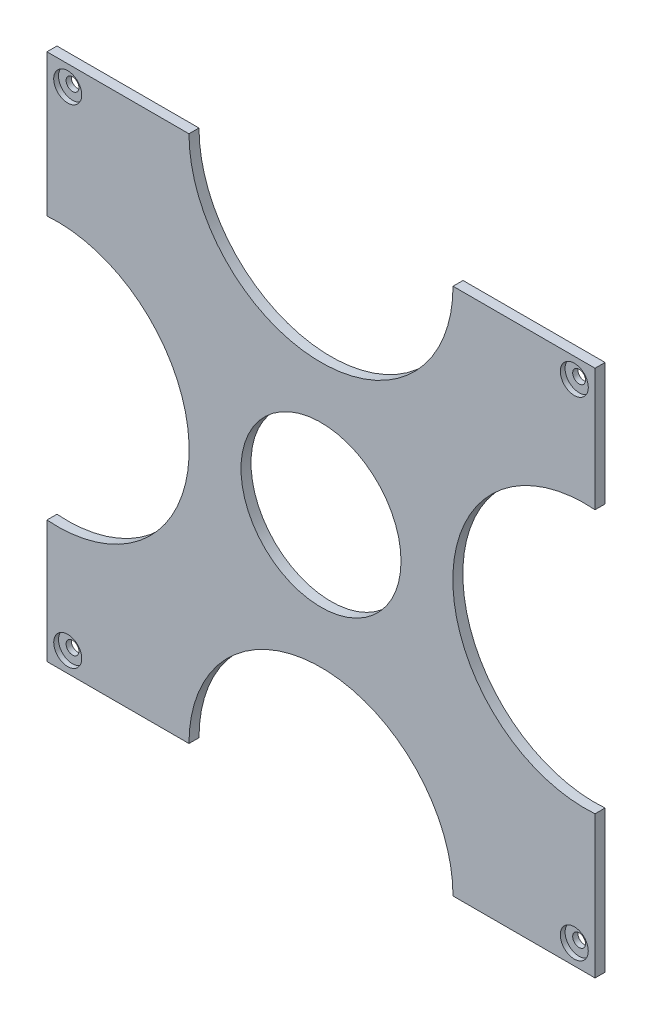
ISO-10303-21;
HEADER;
FILE_DESCRIPTION(('STEP AP214'),'2;1');
FILE_NAME('part.step','',(''),(''),'','','');
FILE_SCHEMA(('AUTOMOTIVE_DESIGN { 1 0 10303 214 1 1 1 1 }'));
ENDSEC;
DATA;
#1=APPLICATION_CONTEXT('core data for automotive mechanical design processes');
#2=APPLICATION_PROTOCOL_DEFINITION('international standard','automotive_design',2000,#1);
#3=PRODUCT_CONTEXT('',#1,'mechanical');
#4=PRODUCT('Part','Part','',(#3));
#5=PRODUCT_RELATED_PRODUCT_CATEGORY('part','',(#4));
#6=PRODUCT_DEFINITION_FORMATION('','',#4);
#7=PRODUCT_DEFINITION_CONTEXT('part definition',#1,'design');
#8=PRODUCT_DEFINITION('design','',#6,#7);
#9=PRODUCT_DEFINITION_SHAPE('','',#8);
#10=(LENGTH_UNIT() NAMED_UNIT(*) SI_UNIT(.MILLI.,.METRE.));
#11=(NAMED_UNIT(*) PLANE_ANGLE_UNIT() SI_UNIT($,.RADIAN.));
#12=(NAMED_UNIT(*) SI_UNIT($,.STERADIAN.) SOLID_ANGLE_UNIT());
#13=UNCERTAINTY_MEASURE_WITH_UNIT(LENGTH_MEASURE(1.E-05),#10,'distance_accuracy_value','');
#14=(GEOMETRIC_REPRESENTATION_CONTEXT(3) GLOBAL_UNCERTAINTY_ASSIGNED_CONTEXT((#13)) GLOBAL_UNIT_ASSIGNED_CONTEXT((#10,
#11,#12)) REPRESENTATION_CONTEXT('',''));
#15=CARTESIAN_POINT('',(0.,0.,0.));
#16=DIRECTION('',(0.,0.,1.));
#17=DIRECTION('',(1.,0.,0.));
#18=AXIS2_PLACEMENT_3D('',#15,#16,#17);
#19=CARTESIAN_POINT('',(-63.3106060606061,61.,2.5));
#20=DIRECTION('',(0.,0.,-1.));
#21=DIRECTION('',(-1.,0.,0.));
#22=AXIS2_PLACEMENT_3D('',#19,#20,#21);
#23=CYLINDRICAL_SURFACE('',#22,1.6);
#24=CARTESIAN_POINT('',(-63.3106060606061,61.,0.));
#25=DIRECTION('',(0.,0.,1.));
#26=DIRECTION('',(1.,0.,0.));
#27=AXIS2_PLACEMENT_3D('',#24,#25,#26);
#28=CIRCLE('',#27,1.6);
#29=CARTESIAN_POINT('',(-61.7106060606061,61.,0.));
#30=VERTEX_POINT('',#29);
#31=EDGE_CURVE('E560',#30,#30,#28,.T.);
#32=ORIENTED_EDGE('',*,*,#31,.F.);
#33=EDGE_LOOP('',(#32));
#34=FACE_BOUND('',#33,.T.);
#35=CARTESIAN_POINT('',(-63.3106060606061,61.,1.3));
#36=DIRECTION('',(0.,0.,1.));
#37=DIRECTION('',(1.,0.,0.));
#38=AXIS2_PLACEMENT_3D('',#35,#36,#37);
#39=CIRCLE('',#38,1.6);
#40=CARTESIAN_POINT('',(-61.7106060606061,61.,1.3));
#41=VERTEX_POINT('',#40);
#42=EDGE_CURVE('E41',#41,#41,#39,.T.);
#43=ORIENTED_EDGE('',*,*,#42,.T.);
#44=EDGE_LOOP('',(#43));
#45=FACE_BOUND('',#44,.T.);
#46=ADVANCED_FACE('F37',(#34,#45),#23,.F.);
#47=CARTESIAN_POINT('',(63.3106060606061,-61.,2.5));
#48=DIRECTION('',(0.,0.,-1.));
#49=DIRECTION('',(-1.,0.,0.));
#50=AXIS2_PLACEMENT_3D('',#47,#48,#49);
#51=CYLINDRICAL_SURFACE('',#50,1.60000000000001);
#52=CARTESIAN_POINT('',(63.3106060606061,-61.,0.));
#53=DIRECTION('',(0.,0.,1.));
#54=DIRECTION('',(1.,0.,0.));
#55=AXIS2_PLACEMENT_3D('',#52,#53,#54);
#56=CIRCLE('',#55,1.60000000000001);
#57=CARTESIAN_POINT('',(64.9106060606061,-61.,0.));
#58=VERTEX_POINT('',#57);
#59=EDGE_CURVE('E349',#58,#58,#56,.T.);
#60=ORIENTED_EDGE('',*,*,#59,.F.);
#61=EDGE_LOOP('',(#60));
#62=FACE_BOUND('',#61,.T.);
#63=CARTESIAN_POINT('',(63.3106060606061,-61.,1.3));
#64=DIRECTION('',(0.,0.,1.));
#65=DIRECTION('',(1.,0.,0.));
#66=AXIS2_PLACEMENT_3D('',#63,#64,#65);
#67=CIRCLE('',#66,1.60000000000001);
#68=CARTESIAN_POINT('',(64.9106060606061,-61.,1.3));
#69=VERTEX_POINT('',#68);
#70=EDGE_CURVE('E252',#69,#69,#67,.T.);
#71=ORIENTED_EDGE('',*,*,#70,.T.);
#72=EDGE_LOOP('',(#71));
#73=FACE_BOUND('',#72,.T.);
#74=ADVANCED_FACE('F276',(#62,#73),#51,.F.);
#75=CARTESIAN_POINT('',(65.9544110739646,2.45268422070566,2.5));
#76=DIRECTION('',(0.,0.,-1.));
#77=DIRECTION('',(-1.,0.,0.));
#78=AXIS2_PLACEMENT_3D('',#75,#76,#77);
#79=CYLINDRICAL_SURFACE('',#78,33.);
#80=CARTESIAN_POINT('',(65.9544110739646,2.45268422070566,0.));
#81=DIRECTION('',(0.,0.,1.));
#82=DIRECTION('',(1.,0.,0.));
#83=AXIS2_PLACEMENT_3D('',#80,#81,#82);
#84=CIRCLE('',#83,33.);
#85=CARTESIAN_POINT('',(68.5,35.3543555615304,0.));
#86=VERTEX_POINT('',#85);
#87=CARTESIAN_POINT('',(68.5,-30.4489871201191,0.));
#88=VERTEX_POINT('',#87);
#89=EDGE_CURVE('E242',#86,#88,#84,.T.);
#90=ORIENTED_EDGE('',*,*,#89,.F.);
#91=DIRECTION('',(0.,0.,-1.));
#92=VECTOR('',#91,1.);
#93=CARTESIAN_POINT('',(68.5,35.3543555615304,2.5));
#94=LINE('',#93,#92);
#95=CARTESIAN_POINT('',(68.5,35.3543555615304,2.5));
#96=VERTEX_POINT('',#95);
#97=EDGE_CURVE('E11',#96,#86,#94,.T.);
#98=ORIENTED_EDGE('',*,*,#97,.F.);
#99=CARTESIAN_POINT('',(65.9544110739646,2.45268422070566,2.5));
#100=DIRECTION('',(0.,0.,1.));
#101=DIRECTION('',(1.,0.,0.));
#102=AXIS2_PLACEMENT_3D('',#99,#100,#101);
#103=CIRCLE('',#102,33.);
#104=CARTESIAN_POINT('',(68.5,-30.4489871201191,2.5));
#105=VERTEX_POINT('',#104);
#106=EDGE_CURVE('E178',#96,#105,#103,.T.);
#107=ORIENTED_EDGE('',*,*,#106,.T.);
#108=DIRECTION('',(0.,0.,-1.));
#109=VECTOR('',#108,1.);
#110=CARTESIAN_POINT('',(68.5,-30.4489871201191,2.5));
#111=LINE('',#110,#109);
#112=EDGE_CURVE('E56',#105,#88,#111,.T.);
#113=ORIENTED_EDGE('',*,*,#112,.T.);
#114=EDGE_LOOP('',(#90,#98,#107,#113));
#115=FACE_BOUND('',#114,.T.);
#116=ADVANCED_FACE('F39',(#115),#79,.F.);
#117=CARTESIAN_POINT('',(68.5,0.,2.5));
#118=DIRECTION('',(1.,0.,0.));
#119=DIRECTION('',(0.,1.,0.));
#120=AXIS2_PLACEMENT_3D('',#117,#118,#119);
#121=PLANE('',#120);
#122=DIRECTION('',(0.,-1.,0.));
#123=VECTOR('',#122,1.);
#124=CARTESIAN_POINT('',(68.5,0.,0.));
#125=LINE('',#124,#123);
#126=CARTESIAN_POINT('',(68.5,66.,0.));
#127=VERTEX_POINT('',#126);
#128=EDGE_CURVE('E244',#127,#86,#125,.T.);
#129=ORIENTED_EDGE('',*,*,#128,.F.);
#130=DIRECTION('',(0.,0.,-1.));
#131=VECTOR('',#130,1.);
#132=CARTESIAN_POINT('',(68.5,66.,2.5));
#133=LINE('',#132,#131);
#134=CARTESIAN_POINT('',(68.5,66.,2.5));
#135=VERTEX_POINT('',#134);
#136=EDGE_CURVE('E47',#135,#127,#133,.T.);
#137=ORIENTED_EDGE('',*,*,#136,.F.);
#138=DIRECTION('',(0.,-1.,0.));
#139=VECTOR('',#138,1.);
#140=CARTESIAN_POINT('',(68.5,0.,2.5));
#141=LINE('',#140,#139);
#142=EDGE_CURVE('E155',#135,#96,#141,.T.);
#143=ORIENTED_EDGE('',*,*,#142,.T.);
#144=ORIENTED_EDGE('',*,*,#97,.T.);
#145=EDGE_LOOP('',(#129,#137,#143,#144));
#146=FACE_BOUND('',#145,.T.);
#147=ADVANCED_FACE('F295',(#146),#121,.T.);
#148=CARTESIAN_POINT('',(0.,66.,2.5));
#149=DIRECTION('',(0.,1.,0.));
#150=DIRECTION('',(0.,0.,1.));
#151=AXIS2_PLACEMENT_3D('',#148,#149,#150);
#152=PLANE('',#151);
#153=DIRECTION('',(1.,0.,0.));
#154=VECTOR('',#153,1.);
#155=CARTESIAN_POINT('',(0.,66.,0.));
#156=LINE('',#155,#154);
#157=CARTESIAN_POINT('',(33.,66.,0.));
#158=VERTEX_POINT('',#157);
#159=EDGE_CURVE('E330',#158,#127,#156,.T.);
#160=ORIENTED_EDGE('',*,*,#159,.F.);
#161=DIRECTION('',(0.,0.,-1.));
#162=VECTOR('',#161,1.);
#163=CARTESIAN_POINT('',(33.,66.,2.5));
#164=LINE('',#163,#162);
#165=CARTESIAN_POINT('',(33.,66.,2.5));
#166=VERTEX_POINT('',#165);
#167=EDGE_CURVE('E325',#166,#158,#164,.T.);
#168=ORIENTED_EDGE('',*,*,#167,.F.);
#169=DIRECTION('',(1.,0.,0.));
#170=VECTOR('',#169,1.);
#171=CARTESIAN_POINT('',(0.,66.,2.5));
#172=LINE('',#171,#170);
#173=EDGE_CURVE('E171',#166,#135,#172,.T.);
#174=ORIENTED_EDGE('',*,*,#173,.T.);
#175=ORIENTED_EDGE('',*,*,#136,.T.);
#176=EDGE_LOOP('',(#160,#168,#174,#175));
#177=FACE_BOUND('',#176,.T.);
#178=ADVANCED_FACE('F313',(#177),#152,.T.);
#179=CARTESIAN_POINT('',(0.,66.,2.5));
#180=DIRECTION('',(0.,0.,-1.));
#181=DIRECTION('',(-1.,0.,0.));
#182=AXIS2_PLACEMENT_3D('',#179,#180,#181);
#183=CYLINDRICAL_SURFACE('',#182,33.);
#184=CARTESIAN_POINT('',(0.,66.,0.));
#185=DIRECTION('',(0.,0.,1.));
#186=DIRECTION('',(1.,0.,0.));
#187=AXIS2_PLACEMENT_3D('',#184,#185,#186);
#188=CIRCLE('',#187,33.);
#189=CARTESIAN_POINT('',(-33.,66.,0.));
#190=VERTEX_POINT('',#189);
#191=EDGE_CURVE('E321',#190,#158,#188,.T.);
#192=ORIENTED_EDGE('',*,*,#191,.F.);
#193=DIRECTION('',(0.,0.,-1.));
#194=VECTOR('',#193,1.);
#195=CARTESIAN_POINT('',(-33.,66.,2.5));
#196=LINE('',#195,#194);
#197=CARTESIAN_POINT('',(-33.,66.,2.5));
#198=VERTEX_POINT('',#197);
#199=EDGE_CURVE('E323',#198,#190,#196,.T.);
#200=ORIENTED_EDGE('',*,*,#199,.F.);
#201=CARTESIAN_POINT('',(0.,66.,2.5));
#202=DIRECTION('',(0.,0.,1.));
#203=DIRECTION('',(1.,0.,0.));
#204=AXIS2_PLACEMENT_3D('',#201,#202,#203);
#205=CIRCLE('',#204,33.);
#206=EDGE_CURVE('E169',#198,#166,#205,.T.);
#207=ORIENTED_EDGE('',*,*,#206,.T.);
#208=ORIENTED_EDGE('',*,*,#167,.T.);
#209=EDGE_LOOP('',(#192,#200,#207,#208));
#210=FACE_BOUND('',#209,.T.);
#211=ADVANCED_FACE('F312',(#210),#183,.F.);
#212=CARTESIAN_POINT('',(-68.5,66.,0.));
#213=VERTEX_POINT('',#212);
#214=EDGE_CURVE('E329',#213,#190,#156,.T.);
#215=ORIENTED_EDGE('',*,*,#214,.F.);
#216=DIRECTION('',(0.,0.,-1.));
#217=VECTOR('',#216,1.);
#218=CARTESIAN_POINT('',(-68.5,66.,2.5));
#219=LINE('',#218,#217);
#220=CARTESIAN_POINT('',(-68.5,66.,2.5));
#221=VERTEX_POINT('',#220);
#222=EDGE_CURVE('E367',#221,#213,#219,.T.);
#223=ORIENTED_EDGE('',*,*,#222,.F.);
#224=EDGE_CURVE('E164',#221,#198,#172,.T.);
#225=ORIENTED_EDGE('',*,*,#224,.T.);
#226=ORIENTED_EDGE('',*,*,#199,.T.);
#227=EDGE_LOOP('',(#215,#223,#225,#226));
#228=FACE_BOUND('',#227,.T.);
#229=ADVANCED_FACE('F310',(#228),#152,.T.);
#230=CARTESIAN_POINT('',(-68.5,0.,2.5));
#231=DIRECTION('',(1.,0.,0.));
#232=DIRECTION('',(0.,1.,0.));
#233=AXIS2_PLACEMENT_3D('',#230,#231,#232);
#234=PLANE('',#233);
#235=DIRECTION('',(0.,-1.,0.));
#236=VECTOR('',#235,1.);
#237=CARTESIAN_POINT('',(-68.5,0.,0.));
#238=LINE('',#237,#236);
#239=CARTESIAN_POINT('',(-68.5,30.4489871201191,0.));
#240=VERTEX_POINT('',#239);
#241=EDGE_CURVE('E336',#213,#240,#238,.T.);
#242=ORIENTED_EDGE('',*,*,#241,.T.);
#243=DIRECTION('',(0.,0.,-1.));
#244=VECTOR('',#243,1.);
#245=CARTESIAN_POINT('',(-68.5,30.4489871201191,2.5));
#246=LINE('',#245,#244);
#247=CARTESIAN_POINT('',(-68.5,30.4489871201191,2.5));
#248=VERTEX_POINT('',#247);
#249=EDGE_CURVE('E364',#248,#240,#246,.T.);
#250=ORIENTED_EDGE('',*,*,#249,.F.);
#251=DIRECTION('',(0.,-1.,0.));
#252=VECTOR('',#251,1.);
#253=CARTESIAN_POINT('',(-68.5,0.,2.5));
#254=LINE('',#253,#252);
#255=EDGE_CURVE('E160',#221,#248,#254,.T.);
#256=ORIENTED_EDGE('',*,*,#255,.F.);
#257=ORIENTED_EDGE('',*,*,#222,.T.);
#258=EDGE_LOOP('',(#242,#250,#256,#257));
#259=FACE_BOUND('',#258,.T.);
#260=ADVANCED_FACE('F306',(#259),#234,.F.);
#261=CARTESIAN_POINT('',(-65.9544110739646,-2.45268422070566,2.5));
#262=DIRECTION('',(0.,0.,-1.));
#263=DIRECTION('',(-1.,0.,0.));
#264=AXIS2_PLACEMENT_3D('',#261,#262,#263);
#265=CYLINDRICAL_SURFACE('',#264,33.);
#266=CARTESIAN_POINT('',(-65.9544110739646,-2.45268422070566,0.));
#267=DIRECTION('',(0.,0.,1.));
#268=DIRECTION('',(1.,0.,0.));
#269=AXIS2_PLACEMENT_3D('',#266,#267,#268);
#270=CIRCLE('',#269,33.);
#271=CARTESIAN_POINT('',(-68.5,-35.3543555615304,0.));
#272=VERTEX_POINT('',#271);
#273=EDGE_CURVE('E338',#240,#272,#270,.F.);
#274=ORIENTED_EDGE('',*,*,#273,.T.);
#275=DIRECTION('',(0.,0.,-1.));
#276=VECTOR('',#275,1.);
#277=CARTESIAN_POINT('',(-68.5,-35.3543555615304,2.5));
#278=LINE('',#277,#276);
#279=CARTESIAN_POINT('',(-68.5,-35.3543555615304,2.5));
#280=VERTEX_POINT('',#279);
#281=EDGE_CURVE('E363',#280,#272,#278,.T.);
#282=ORIENTED_EDGE('',*,*,#281,.F.);
#283=CARTESIAN_POINT('',(-65.9544110739646,-2.45268422070566,2.5));
#284=DIRECTION('',(0.,0.,1.));
#285=DIRECTION('',(1.,0.,0.));
#286=AXIS2_PLACEMENT_3D('',#283,#284,#285);
#287=CIRCLE('',#286,33.);
#288=EDGE_CURVE('E158',#248,#280,#287,.F.);
#289=ORIENTED_EDGE('',*,*,#288,.F.);
#290=ORIENTED_EDGE('',*,*,#249,.T.);
#291=EDGE_LOOP('',(#274,#282,#289,#290));
#292=FACE_BOUND('',#291,.T.);
#293=ADVANCED_FACE('F304',(#292),#265,.F.);
#294=CARTESIAN_POINT('',(-68.5,-66.,0.));
#295=VERTEX_POINT('',#294);
#296=EDGE_CURVE('E340',#272,#295,#238,.T.);
#297=ORIENTED_EDGE('',*,*,#296,.T.);
#298=DIRECTION('',(0.,0.,-1.));
#299=VECTOR('',#298,1.);
#300=CARTESIAN_POINT('',(-68.5,-66.,2.5));
#301=LINE('',#300,#299);
#302=CARTESIAN_POINT('',(-68.5,-66.,2.5));
#303=VERTEX_POINT('',#302);
#304=EDGE_CURVE('E365',#303,#295,#301,.T.);
#305=ORIENTED_EDGE('',*,*,#304,.F.);
#306=EDGE_CURVE('E157',#280,#303,#254,.T.);
#307=ORIENTED_EDGE('',*,*,#306,.F.);
#308=ORIENTED_EDGE('',*,*,#281,.T.);
#309=EDGE_LOOP('',(#297,#305,#307,#308));
#310=FACE_BOUND('',#309,.T.);
#311=ADVANCED_FACE('F301',(#310),#234,.F.);
#312=CARTESIAN_POINT('',(0.,-66.,2.5));
#313=DIRECTION('',(0.,1.,0.));
#314=DIRECTION('',(0.,0.,1.));
#315=AXIS2_PLACEMENT_3D('',#312,#313,#314);
#316=PLANE('',#315);
#317=DIRECTION('',(1.,0.,0.));
#318=VECTOR('',#317,1.);
#319=CARTESIAN_POINT('',(0.,-66.,0.));
#320=LINE('',#319,#318);
#321=CARTESIAN_POINT('',(-33.,-66.,0.));
#322=VERTEX_POINT('',#321);
#323=EDGE_CURVE('E352',#295,#322,#320,.T.);
#324=ORIENTED_EDGE('',*,*,#323,.T.);
#325=DIRECTION('',(0.,0.,-1.));
#326=VECTOR('',#325,1.);
#327=CARTESIAN_POINT('',(-33.,-66.,2.5));
#328=LINE('',#327,#326);
#329=CARTESIAN_POINT('',(-33.,-66.,2.5));
#330=VERTEX_POINT('',#329);
#331=EDGE_CURVE('E149',#330,#322,#328,.T.);
#332=ORIENTED_EDGE('',*,*,#331,.F.);
#333=DIRECTION('',(1.,0.,0.));
#334=VECTOR('',#333,1.);
#335=CARTESIAN_POINT('',(0.,-66.,2.5));
#336=LINE('',#335,#334);
#337=EDGE_CURVE('E137',#303,#330,#336,.T.);
#338=ORIENTED_EDGE('',*,*,#337,.F.);
#339=ORIENTED_EDGE('',*,*,#304,.T.);
#340=EDGE_LOOP('',(#324,#332,#338,#339));
#341=FACE_BOUND('',#340,.T.);
#342=ADVANCED_FACE('F298',(#341),#316,.F.);
#343=CARTESIAN_POINT('',(0.,-66.,2.5));
#344=DIRECTION('',(0.,0.,-1.));
#345=DIRECTION('',(-1.,0.,0.));
#346=AXIS2_PLACEMENT_3D('',#343,#344,#345);
#347=CYLINDRICAL_SURFACE('',#346,33.);
#348=CARTESIAN_POINT('',(0.,-66.,0.));
#349=DIRECTION('',(0.,0.,1.));
#350=DIRECTION('',(1.,0.,0.));
#351=AXIS2_PLACEMENT_3D('',#348,#349,#350);
#352=CIRCLE('',#351,33.);
#353=CARTESIAN_POINT('',(33.,-66.,0.));
#354=VERTEX_POINT('',#353);
#355=EDGE_CURVE('E146',#322,#354,#352,.F.);
#356=ORIENTED_EDGE('',*,*,#355,.T.);
#357=DIRECTION('',(0.,0.,-1.));
#358=VECTOR('',#357,1.);
#359=CARTESIAN_POINT('',(33.,-66.,2.5));
#360=LINE('',#359,#358);
#361=CARTESIAN_POINT('',(33.,-66.,2.5));
#362=VERTEX_POINT('',#361);
#363=EDGE_CURVE('E143',#362,#354,#360,.T.);
#364=ORIENTED_EDGE('',*,*,#363,.F.);
#365=CARTESIAN_POINT('',(0.,-66.,2.5));
#366=DIRECTION('',(0.,0.,1.));
#367=DIRECTION('',(1.,0.,0.));
#368=AXIS2_PLACEMENT_3D('',#365,#366,#367);
#369=CIRCLE('',#368,33.);
#370=EDGE_CURVE('E130',#330,#362,#369,.F.);
#371=ORIENTED_EDGE('',*,*,#370,.F.);
#372=ORIENTED_EDGE('',*,*,#331,.T.);
#373=EDGE_LOOP('',(#356,#364,#371,#372));
#374=FACE_BOUND('',#373,.T.);
#375=ADVANCED_FACE('F144',(#374),#347,.F.);
#376=CARTESIAN_POINT('',(68.5,-66.,0.));
#377=VERTEX_POINT('',#376);
#378=EDGE_CURVE('E347',#354,#377,#320,.T.);
#379=ORIENTED_EDGE('',*,*,#378,.T.);
#380=DIRECTION('',(0.,0.,-1.));
#381=VECTOR('',#380,1.);
#382=CARTESIAN_POINT('',(68.5,-66.,2.5));
#383=LINE('',#382,#381);
#384=CARTESIAN_POINT('',(68.5,-66.,2.5));
#385=VERTEX_POINT('',#384);
#386=EDGE_CURVE('E94',#385,#377,#383,.T.);
#387=ORIENTED_EDGE('',*,*,#386,.F.);
#388=EDGE_CURVE('E135',#362,#385,#336,.T.);
#389=ORIENTED_EDGE('',*,*,#388,.F.);
#390=ORIENTED_EDGE('',*,*,#363,.T.);
#391=EDGE_LOOP('',(#379,#387,#389,#390));
#392=FACE_BOUND('',#391,.T.);
#393=ADVANCED_FACE('F151',(#392),#316,.F.);
#394=CARTESIAN_POINT('',(-63.3106060606061,-61.,2.5));
#395=DIRECTION('',(0.,0.,-1.));
#396=DIRECTION('',(-1.,0.,0.));
#397=AXIS2_PLACEMENT_3D('',#394,#395,#396);
#398=CYLINDRICAL_SURFACE('',#397,1.6);
#399=CARTESIAN_POINT('',(-63.3106060606061,-61.,1.3));
#400=DIRECTION('',(0.,0.,-1.));
#401=DIRECTION('',(-1.,0.,0.));
#402=AXIS2_PLACEMENT_3D('',#399,#400,#401);
#403=CIRCLE('',#402,1.6);
#404=CARTESIAN_POINT('',(-64.9106060606061,-61.,1.3));
#405=VERTEX_POINT('',#404);
#406=EDGE_CURVE('E250',#405,#405,#403,.F.);
#407=ORIENTED_EDGE('',*,*,#406,.T.);
#408=EDGE_LOOP('',(#407));
#409=FACE_BOUND('',#408,.T.);
#410=CARTESIAN_POINT('',(-63.3106060606061,-61.,0.));
#411=DIRECTION('',(0.,0.,1.));
#412=DIRECTION('',(1.,0.,0.));
#413=AXIS2_PLACEMENT_3D('',#410,#411,#412);
#414=CIRCLE('',#413,1.6);
#415=CARTESIAN_POINT('',(-61.7106060606061,-61.,0.));
#416=VERTEX_POINT('',#415);
#417=EDGE_CURVE('E346',#416,#416,#414,.F.);
#418=ORIENTED_EDGE('',*,*,#417,.T.);
#419=EDGE_LOOP('',(#418));
#420=FACE_BOUND('',#419,.T.);
#421=ADVANCED_FACE('F288',(#409,#420),#398,.F.);
#422=EDGE_CURVE('E343',#88,#377,#125,.T.);
#423=ORIENTED_EDGE('',*,*,#422,.F.);
#424=ORIENTED_EDGE('',*,*,#112,.F.);
#425=EDGE_CURVE('E152',#105,#385,#141,.T.);
#426=ORIENTED_EDGE('',*,*,#425,.T.);
#427=ORIENTED_EDGE('',*,*,#386,.T.);
#428=EDGE_LOOP('',(#423,#424,#426,#427));
#429=FACE_BOUND('',#428,.T.);
#430=ADVANCED_FACE('F291',(#429),#121,.T.);
#431=CARTESIAN_POINT('',(63.3106060606061,61.,2.5));
#432=DIRECTION('',(0.,0.,-1.));
#433=DIRECTION('',(-1.,0.,0.));
#434=AXIS2_PLACEMENT_3D('',#431,#432,#433);
#435=CYLINDRICAL_SURFACE('',#434,1.60000000000001);
#436=CARTESIAN_POINT('',(63.3106060606061,61.,1.3));
#437=DIRECTION('',(0.,0.,-1.));
#438=DIRECTION('',(-1.,0.,0.));
#439=AXIS2_PLACEMENT_3D('',#436,#437,#438);
#440=CIRCLE('',#439,1.60000000000001);
#441=CARTESIAN_POINT('',(61.7106060606061,61.,1.3));
#442=VERTEX_POINT('',#441);
#443=EDGE_CURVE('E195',#442,#442,#440,.F.);
#444=ORIENTED_EDGE('',*,*,#443,.T.);
#445=EDGE_LOOP('',(#444));
#446=FACE_BOUND('',#445,.T.);
#447=CARTESIAN_POINT('',(63.3106060606061,61.,0.));
#448=DIRECTION('',(0.,0.,1.));
#449=DIRECTION('',(1.,0.,0.));
#450=AXIS2_PLACEMENT_3D('',#447,#448,#449);
#451=CIRCLE('',#450,1.60000000000001);
#452=CARTESIAN_POINT('',(64.9106060606061,61.,0.));
#453=VERTEX_POINT('',#452);
#454=EDGE_CURVE('E181',#453,#453,#451,.F.);
#455=ORIENTED_EDGE('',*,*,#454,.T.);
#456=EDGE_LOOP('',(#455));
#457=FACE_BOUND('',#456,.T.);
#458=ADVANCED_FACE('F227',(#446,#457),#435,.F.);
#459=CARTESIAN_POINT('',(0.,0.,2.5));
#460=DIRECTION('',(0.,0.,1.));
#461=DIRECTION('',(1.,0.,0.));
#462=AXIS2_PLACEMENT_3D('',#459,#460,#461);
#463=PLANE('',#462);
#464=CARTESIAN_POINT('',(-63.3106060606061,-61.,2.5));
#465=DIRECTION('',(0.,0.,1.));
#466=DIRECTION('',(-1.,0.,0.));
#467=AXIS2_PLACEMENT_3D('',#464,#465,#466);
#468=CIRCLE('',#467,3.50000000000001);
#469=CARTESIAN_POINT('',(-66.8106060606061,-61.,2.5));
#470=VERTEX_POINT('',#469);
#471=EDGE_CURVE('E196',#470,#470,#468,.T.);
#472=ORIENTED_EDGE('',*,*,#471,.F.);
#473=EDGE_LOOP('',(#472));
#474=FACE_BOUND('',#473,.T.);
#475=CARTESIAN_POINT('',(-63.3106060606061,61.,2.5));
#476=DIRECTION('',(0.,0.,1.));
#477=DIRECTION('',(1.,0.,0.));
#478=AXIS2_PLACEMENT_3D('',#475,#476,#477);
#479=CIRCLE('',#478,3.50000000000001);
#480=CARTESIAN_POINT('',(-59.8106060606061,61.,2.5));
#481=VERTEX_POINT('',#480);
#482=EDGE_CURVE('E202',#481,#481,#479,.T.);
#483=ORIENTED_EDGE('',*,*,#482,.F.);
#484=EDGE_LOOP('',(#483));
#485=FACE_BOUND('',#484,.T.);
#486=CARTESIAN_POINT('',(63.3106060606061,61.,2.5));
#487=DIRECTION('',(0.,0.,1.));
#488=DIRECTION('',(-1.,0.,0.));
#489=AXIS2_PLACEMENT_3D('',#486,#487,#488);
#490=CIRCLE('',#489,3.50000000000001);
#491=CARTESIAN_POINT('',(59.8106060606061,61.,2.5));
#492=VERTEX_POINT('',#491);
#493=EDGE_CURVE('E208',#492,#492,#490,.T.);
#494=ORIENTED_EDGE('',*,*,#493,.F.);
#495=EDGE_LOOP('',(#494));
#496=FACE_BOUND('',#495,.T.);
#497=CARTESIAN_POINT('',(63.3106060606061,-61.,2.5));
#498=DIRECTION('',(0.,0.,1.));
#499=DIRECTION('',(1.,0.,0.));
#500=AXIS2_PLACEMENT_3D('',#497,#498,#499);
#501=CIRCLE('',#500,3.50000000000001);
#502=CARTESIAN_POINT('',(66.8106060606061,-61.,2.5));
#503=VERTEX_POINT('',#502);
#504=EDGE_CURVE('E188',#503,#503,#501,.T.);
#505=ORIENTED_EDGE('',*,*,#504,.F.);
#506=EDGE_LOOP('',(#505));
#507=FACE_BOUND('',#506,.T.);
#508=CARTESIAN_POINT('',(0.,0.,2.5));
#509=DIRECTION('',(0.,0.,1.));
#510=DIRECTION('',(1.,0.,0.));
#511=AXIS2_PLACEMENT_3D('',#508,#509,#510);
#512=CIRCLE('',#511,20.);
#513=CARTESIAN_POINT('',(20.,0.,2.5));
#514=VERTEX_POINT('',#513);
#515=EDGE_CURVE('E184',#514,#514,#512,.T.);
#516=ORIENTED_EDGE('',*,*,#515,.F.);
#517=EDGE_LOOP('',(#516));
#518=FACE_BOUND('',#517,.T.);
#519=ORIENTED_EDGE('',*,*,#106,.F.);
#520=ORIENTED_EDGE('',*,*,#142,.F.);
#521=ORIENTED_EDGE('',*,*,#173,.F.);
#522=ORIENTED_EDGE('',*,*,#206,.F.);
#523=ORIENTED_EDGE('',*,*,#224,.F.);
#524=ORIENTED_EDGE('',*,*,#255,.T.);
#525=ORIENTED_EDGE('',*,*,#288,.T.);
#526=ORIENTED_EDGE('',*,*,#306,.T.);
#527=ORIENTED_EDGE('',*,*,#337,.T.);
#528=ORIENTED_EDGE('',*,*,#370,.T.);
#529=ORIENTED_EDGE('',*,*,#388,.T.);
#530=ORIENTED_EDGE('',*,*,#425,.F.);
#531=EDGE_LOOP('',(#519,#520,#521,#522,#523,#524,#525,#526,#527,#528,#529,#530));
#532=FACE_BOUND('',#531,.T.);
#533=ADVANCED_FACE('F132',(#474,#485,#496,#507,#518,#532),#463,.T.);
#534=CARTESIAN_POINT('',(0.,0.,0.));
#535=DIRECTION('',(0.,0.,1.));
#536=DIRECTION('',(1.,0.,0.));
#537=AXIS2_PLACEMENT_3D('',#534,#535,#536);
#538=PLANE('',#537);
#539=CARTESIAN_POINT('',(0.,0.,0.));
#540=DIRECTION('',(0.,0.,1.));
#541=DIRECTION('',(1.,0.,0.));
#542=AXIS2_PLACEMENT_3D('',#539,#540,#541);
#543=CIRCLE('',#542,20.);
#544=CARTESIAN_POINT('',(20.,0.,0.));
#545=VERTEX_POINT('',#544);
#546=EDGE_CURVE('E187',#545,#545,#543,.T.);
#547=ORIENTED_EDGE('',*,*,#546,.T.);
#548=EDGE_LOOP('',(#547));
#549=FACE_BOUND('',#548,.T.);
#550=ORIENTED_EDGE('',*,*,#89,.T.);
#551=ORIENTED_EDGE('',*,*,#422,.T.);
#552=ORIENTED_EDGE('',*,*,#378,.F.);
#553=ORIENTED_EDGE('',*,*,#355,.F.);
#554=ORIENTED_EDGE('',*,*,#323,.F.);
#555=ORIENTED_EDGE('',*,*,#296,.F.);
#556=ORIENTED_EDGE('',*,*,#273,.F.);
#557=ORIENTED_EDGE('',*,*,#241,.F.);
#558=ORIENTED_EDGE('',*,*,#214,.T.);
#559=ORIENTED_EDGE('',*,*,#191,.T.);
#560=ORIENTED_EDGE('',*,*,#159,.T.);
#561=ORIENTED_EDGE('',*,*,#128,.T.);
#562=EDGE_LOOP('',(#550,#551,#552,#553,#554,#555,#556,#557,#558,#559,#560,#561));
#563=FACE_BOUND('',#562,.T.);
#564=ORIENTED_EDGE('',*,*,#417,.F.);
#565=EDGE_LOOP('',(#564));
#566=FACE_BOUND('',#565,.T.);
#567=ORIENTED_EDGE('',*,*,#59,.T.);
#568=EDGE_LOOP('',(#567));
#569=FACE_BOUND('',#568,.T.);
#570=ORIENTED_EDGE('',*,*,#31,.T.);
#571=EDGE_LOOP('',(#570));
#572=FACE_BOUND('',#571,.T.);
#573=ORIENTED_EDGE('',*,*,#454,.F.);
#574=EDGE_LOOP('',(#573));
#575=FACE_BOUND('',#574,.T.);
#576=ADVANCED_FACE('F226',(#549,#563,#566,#569,#572,#575),#538,.F.);
#577=CARTESIAN_POINT('',(0.,0.,-20.5));
#578=DIRECTION('',(0.,0.,1.));
#579=DIRECTION('',(1.,0.,0.));
#580=AXIS2_PLACEMENT_3D('',#577,#578,#579);
#581=CYLINDRICAL_SURFACE('',#580,20.);
#582=ORIENTED_EDGE('',*,*,#515,.T.);
#583=EDGE_LOOP('',(#582));
#584=FACE_BOUND('',#583,.T.);
#585=ORIENTED_EDGE('',*,*,#546,.F.);
#586=EDGE_LOOP('',(#585));
#587=FACE_BOUND('',#586,.T.);
#588=ADVANCED_FACE('F234',(#584,#587),#581,.F.);
#589=CARTESIAN_POINT('',(63.3106060606061,-61.,1.3));
#590=DIRECTION('',(0.,0.,1.));
#591=DIRECTION('',(1.,0.,0.));
#592=AXIS2_PLACEMENT_3D('',#589,#590,#591);
#593=CYLINDRICAL_SURFACE('',#592,3.50000000000001);
#594=CARTESIAN_POINT('',(63.3106060606061,-61.,1.3));
#595=DIRECTION('',(0.,0.,1.));
#596=DIRECTION('',(1.,0.,0.));
#597=AXIS2_PLACEMENT_3D('',#594,#595,#596);
#598=CIRCLE('',#597,3.50000000000001);
#599=CARTESIAN_POINT('',(66.8106060606061,-61.,1.3));
#600=VERTEX_POINT('',#599);
#601=EDGE_CURVE('E191',#600,#600,#598,.T.);
#602=ORIENTED_EDGE('',*,*,#601,.F.);
#603=EDGE_LOOP('',(#602));
#604=FACE_BOUND('',#603,.T.);
#605=ORIENTED_EDGE('',*,*,#504,.T.);
#606=EDGE_LOOP('',(#605));
#607=FACE_BOUND('',#606,.T.);
#608=ADVANCED_FACE('F237',(#604,#607),#593,.F.);
#609=CARTESIAN_POINT('',(63.3106060606061,-61.,1.3));
#610=DIRECTION('',(0.,0.,1.));
#611=DIRECTION('',(1.,0.,0.));
#612=AXIS2_PLACEMENT_3D('',#609,#610,#611);
#613=PLANE('',#612);
#614=ORIENTED_EDGE('',*,*,#70,.F.);
#615=EDGE_LOOP('',(#614));
#616=FACE_BOUND('',#615,.T.);
#617=ORIENTED_EDGE('',*,*,#601,.T.);
#618=EDGE_LOOP('',(#617));
#619=FACE_BOUND('',#618,.T.);
#620=ADVANCED_FACE('F491',(#616,#619),#613,.T.);
#621=CARTESIAN_POINT('',(63.3106060606061,61.,1.3));
#622=DIRECTION('',(0.,0.,-1.));
#623=DIRECTION('',(-1.,0.,0.));
#624=AXIS2_PLACEMENT_3D('',#621,#622,#623);
#625=PLANE('',#624);
#626=CARTESIAN_POINT('',(63.3106060606061,61.,1.3));
#627=DIRECTION('',(0.,0.,1.));
#628=DIRECTION('',(-1.,0.,0.));
#629=AXIS2_PLACEMENT_3D('',#626,#627,#628);
#630=CIRCLE('',#629,3.50000000000001);
#631=CARTESIAN_POINT('',(59.8106060606061,61.,1.3));
#632=VERTEX_POINT('',#631);
#633=EDGE_CURVE('E192',#632,#632,#630,.T.);
#634=ORIENTED_EDGE('',*,*,#633,.T.);
#635=EDGE_LOOP('',(#634));
#636=FACE_BOUND('',#635,.T.);
#637=ORIENTED_EDGE('',*,*,#443,.F.);
#638=EDGE_LOOP('',(#637));
#639=FACE_BOUND('',#638,.T.);
#640=ADVANCED_FACE('F214',(#636,#639),#625,.F.);
#641=CARTESIAN_POINT('',(63.3106060606061,61.,1.3));
#642=DIRECTION('',(0.,0.,1.));
#643=DIRECTION('',(1.,0.,0.));
#644=AXIS2_PLACEMENT_3D('',#641,#642,#643);
#645=CYLINDRICAL_SURFACE('',#644,3.50000000000001);
#646=ORIENTED_EDGE('',*,*,#633,.F.);
#647=EDGE_LOOP('',(#646));
#648=FACE_BOUND('',#647,.T.);
#649=ORIENTED_EDGE('',*,*,#493,.T.);
#650=EDGE_LOOP('',(#649));
#651=FACE_BOUND('',#650,.T.);
#652=ADVANCED_FACE('F217',(#648,#651),#645,.F.);
#653=CARTESIAN_POINT('',(-63.3106060606061,61.,1.3));
#654=DIRECTION('',(0.,0.,1.));
#655=DIRECTION('',(1.,0.,0.));
#656=AXIS2_PLACEMENT_3D('',#653,#654,#655);
#657=CYLINDRICAL_SURFACE('',#656,3.50000000000001);
#658=CARTESIAN_POINT('',(-63.3106060606061,61.,1.3));
#659=DIRECTION('',(0.,0.,1.));
#660=DIRECTION('',(1.,0.,0.));
#661=AXIS2_PLACEMENT_3D('',#658,#659,#660);
#662=CIRCLE('',#661,3.50000000000001);
#663=CARTESIAN_POINT('',(-59.8106060606061,61.,1.3));
#664=VERTEX_POINT('',#663);
#665=EDGE_CURVE('E205',#664,#664,#662,.T.);
#666=ORIENTED_EDGE('',*,*,#665,.F.);
#667=EDGE_LOOP('',(#666));
#668=FACE_BOUND('',#667,.T.);
#669=ORIENTED_EDGE('',*,*,#482,.T.);
#670=EDGE_LOOP('',(#669));
#671=FACE_BOUND('',#670,.T.);
#672=ADVANCED_FACE('F220',(#668,#671),#657,.F.);
#673=CARTESIAN_POINT('',(-63.3106060606061,61.,1.3));
#674=DIRECTION('',(0.,0.,1.));
#675=DIRECTION('',(1.,0.,0.));
#676=AXIS2_PLACEMENT_3D('',#673,#674,#675);
#677=PLANE('',#676);
#678=ORIENTED_EDGE('',*,*,#42,.F.);
#679=EDGE_LOOP('',(#678));
#680=FACE_BOUND('',#679,.T.);
#681=ORIENTED_EDGE('',*,*,#665,.T.);
#682=EDGE_LOOP('',(#681));
#683=FACE_BOUND('',#682,.T.);
#684=ADVANCED_FACE('F260',(#680,#683),#677,.T.);
#685=CARTESIAN_POINT('',(-63.3106060606061,-61.,1.3));
#686=DIRECTION('',(0.,0.,-1.));
#687=DIRECTION('',(-1.,0.,0.));
#688=AXIS2_PLACEMENT_3D('',#685,#686,#687);
#689=PLANE('',#688);
#690=CARTESIAN_POINT('',(-63.3106060606061,-61.,1.3));
#691=DIRECTION('',(0.,0.,1.));
#692=DIRECTION('',(-1.,0.,0.));
#693=AXIS2_PLACEMENT_3D('',#690,#691,#692);
#694=CIRCLE('',#693,3.50000000000001);
#695=CARTESIAN_POINT('',(-66.8106060606061,-61.,1.3));
#696=VERTEX_POINT('',#695);
#697=EDGE_CURVE('E199',#696,#696,#694,.T.);
#698=ORIENTED_EDGE('',*,*,#697,.T.);
#699=EDGE_LOOP('',(#698));
#700=FACE_BOUND('',#699,.T.);
#701=ORIENTED_EDGE('',*,*,#406,.F.);
#702=EDGE_LOOP('',(#701));
#703=FACE_BOUND('',#702,.T.);
#704=ADVANCED_FACE('F263',(#700,#703),#689,.F.);
#705=CARTESIAN_POINT('',(-63.3106060606061,-61.,1.3));
#706=DIRECTION('',(0.,0.,1.));
#707=DIRECTION('',(1.,0.,0.));
#708=AXIS2_PLACEMENT_3D('',#705,#706,#707);
#709=CYLINDRICAL_SURFACE('',#708,3.50000000000001);
#710=ORIENTED_EDGE('',*,*,#697,.F.);
#711=EDGE_LOOP('',(#710));
#712=FACE_BOUND('',#711,.T.);
#713=ORIENTED_EDGE('',*,*,#471,.T.);
#714=EDGE_LOOP('',(#713));
#715=FACE_BOUND('',#714,.T.);
#716=ADVANCED_FACE('F534',(#712,#715),#709,.F.);
#717=CLOSED_SHELL('',(#46,#74,#116,#147,#178,#211,#229,#260,#293,#311,#342,#375,#393,#421,#430,
#458,#533,#576,#588,#608,#620,#640,#652,#672,#684,#704,#716));
#718=MANIFOLD_SOLID_BREP('B2',#717);
#719=ADVANCED_BREP_SHAPE_REPRESENTATION('',(#18,#718),#14);
#720=SHAPE_DEFINITION_REPRESENTATION(#9,#719);
ENDSEC;
END-ISO-10303-21;
